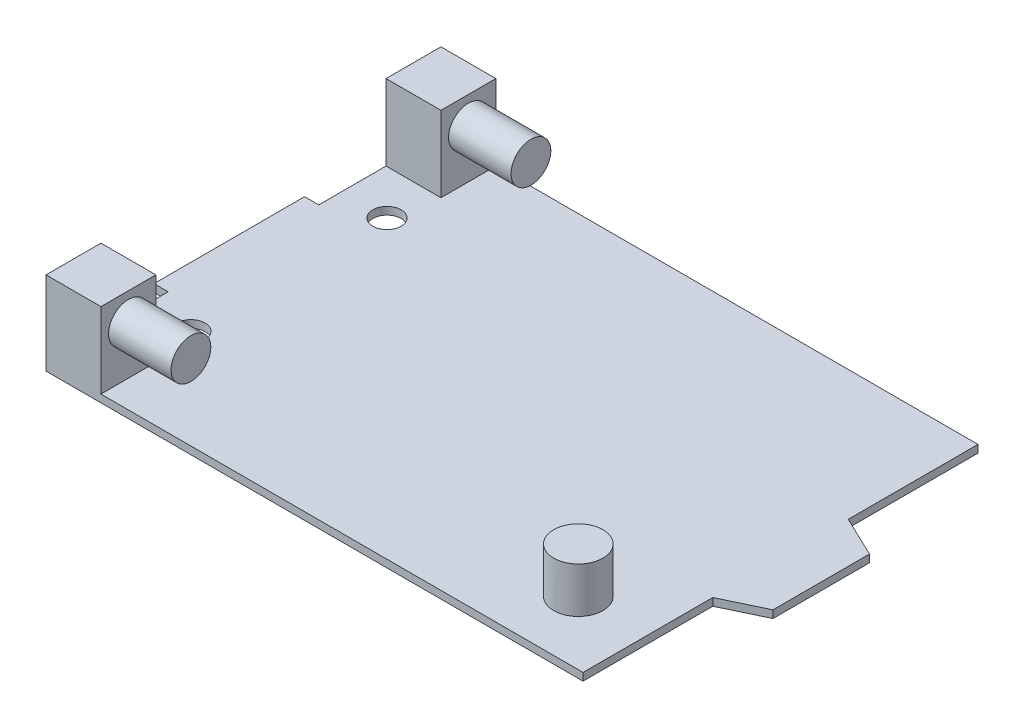
ISO-10303-21;
HEADER;
FILE_DESCRIPTION(('STEP AP214'),'2;1');
FILE_NAME('part.step','',(''),(''),'','','');
FILE_SCHEMA(('AUTOMOTIVE_DESIGN { 1 0 10303 214 1 1 1 1 }'));
ENDSEC;
DATA;
#1=APPLICATION_CONTEXT('core data for automotive mechanical design processes');
#2=APPLICATION_PROTOCOL_DEFINITION('international standard','automotive_design',2000,#1);
#3=PRODUCT_CONTEXT('',#1,'mechanical');
#4=PRODUCT('Part','Part','',(#3));
#5=PRODUCT_RELATED_PRODUCT_CATEGORY('part','',(#4));
#6=PRODUCT_DEFINITION_FORMATION('','',#4);
#7=PRODUCT_DEFINITION_CONTEXT('part definition',#1,'design');
#8=PRODUCT_DEFINITION('design','',#6,#7);
#9=PRODUCT_DEFINITION_SHAPE('','',#8);
#10=(LENGTH_UNIT() NAMED_UNIT(*) SI_UNIT(.MILLI.,.METRE.));
#11=(NAMED_UNIT(*) PLANE_ANGLE_UNIT() SI_UNIT($,.RADIAN.));
#12=(NAMED_UNIT(*) SI_UNIT($,.STERADIAN.) SOLID_ANGLE_UNIT());
#13=UNCERTAINTY_MEASURE_WITH_UNIT(LENGTH_MEASURE(1.E-05),#10,'distance_accuracy_value','');
#14=(GEOMETRIC_REPRESENTATION_CONTEXT(3) GLOBAL_UNCERTAINTY_ASSIGNED_CONTEXT((#13)) GLOBAL_UNIT_ASSIGNED_CONTEXT((#10,
#11,#12)) REPRESENTATION_CONTEXT('',''));
#15=CARTESIAN_POINT('',(0.,0.,0.));
#16=DIRECTION('',(0.,0.,1.));
#17=DIRECTION('',(1.,0.,0.));
#18=AXIS2_PLACEMENT_3D('',#15,#16,#17);
#19=CARTESIAN_POINT('',(0.,1.016,0.));
#20=DIRECTION('',(0.,-1.,0.));
#21=DIRECTION('',(0.,0.,-1.));
#22=AXIS2_PLACEMENT_3D('',#19,#20,#21);
#23=PLANE('',#22);
#24=CARTESIAN_POINT('',(64.77,1.016,7.874));
#25=DIRECTION('',(0.,-1.,0.));
#26=DIRECTION('',(0.,0.,-1.));
#27=AXIS2_PLACEMENT_3D('',#24,#25,#26);
#28=CIRCLE('',#27,3.302);
#29=CARTESIAN_POINT('',(64.77,1.016,4.572));
#30=VERTEX_POINT('',#29);
#31=EDGE_CURVE('E11',#30,#30,#28,.F.);
#32=ORIENTED_EDGE('',*,*,#31,.F.);
#33=EDGE_LOOP('',(#32));
#34=FACE_BOUND('',#33,.T.);
#35=CARTESIAN_POINT('',(8.001,1.016,3.048));
#36=DIRECTION('',(0.,1.,0.));
#37=DIRECTION('',(0.,0.,1.));
#38=AXIS2_PLACEMENT_3D('',#35,#36,#37);
#39=CIRCLE('',#38,1.905);
#40=CARTESIAN_POINT('',(8.001,1.016,4.953));
#41=VERTEX_POINT('',#40);
#42=EDGE_CURVE('E242',#41,#41,#39,.T.);
#43=ORIENTED_EDGE('',*,*,#42,.F.);
#44=EDGE_LOOP('',(#43));
#45=FACE_BOUND('',#44,.T.);
#46=CARTESIAN_POINT('',(8.00099999999999,1.016,-23.241));
#47=DIRECTION('',(0.,1.,0.));
#48=DIRECTION('',(0.,0.,1.));
#49=AXIS2_PLACEMENT_3D('',#46,#47,#48);
#50=CIRCLE('',#49,1.905);
#51=CARTESIAN_POINT('',(8.00099999999999,1.016,-21.336));
#52=VERTEX_POINT('',#51);
#53=EDGE_CURVE('E236',#52,#52,#50,.T.);
#54=ORIENTED_EDGE('',*,*,#53,.F.);
#55=EDGE_LOOP('',(#54));
#56=FACE_BOUND('',#55,.T.);
#57=DIRECTION('',(0.,0.,-1.));
#58=VECTOR('',#57,1.);
#59=CARTESIAN_POINT('',(9.271,1.016,16.383));
#60=LINE('',#59,#58);
#61=CARTESIAN_POINT('',(9.271,1.016,16.383));
#62=VERTEX_POINT('',#61);
#63=CARTESIAN_POINT('',(9.271,1.016,9.017));
#64=VERTEX_POINT('',#63);
#65=EDGE_CURVE('E182',#62,#64,#60,.T.);
#66=ORIENTED_EDGE('',*,*,#65,.F.);
#67=DIRECTION('',(1.,0.,0.));
#68=VECTOR('',#67,1.);
#69=CARTESIAN_POINT('',(1.905,1.016,16.383));
#70=LINE('',#69,#68);
#71=CARTESIAN_POINT('',(73.914,1.016,16.383));
#72=VERTEX_POINT('',#71);
#73=EDGE_CURVE('E171',#62,#72,#70,.T.);
#74=ORIENTED_EDGE('',*,*,#73,.T.);
#75=DIRECTION('',(0.,0.,-1.));
#76=VECTOR('',#75,1.);
#77=CARTESIAN_POINT('',(73.914,1.016,16.383));
#78=LINE('',#77,#76);
#79=CARTESIAN_POINT('',(73.914,1.016,-1.016));
#80=VERTEX_POINT('',#79);
#81=EDGE_CURVE('E180',#72,#80,#78,.T.);
#82=ORIENTED_EDGE('',*,*,#81,.T.);
#83=DIRECTION('',(0.902666413566439,0.,-0.430340964607255));
#84=VECTOR('',#83,1.);
#85=CARTESIAN_POINT('',(73.914,1.016,-1.016));
#86=LINE('',#85,#84);
#87=CARTESIAN_POINT('',(79.375,1.016,-3.6195));
#88=VERTEX_POINT('',#87);
#89=EDGE_CURVE('E253',#80,#88,#86,.T.);
#90=ORIENTED_EDGE('',*,*,#89,.T.);
#91=DIRECTION('',(0.,0.,-1.));
#92=VECTOR('',#91,1.);
#93=CARTESIAN_POINT('',(79.375,1.016,-3.6195));
#94=LINE('',#93,#92);
#95=CARTESIAN_POINT('',(79.375,1.016,-16.5735));
#96=VERTEX_POINT('',#95);
#97=EDGE_CURVE('E255',#88,#96,#94,.T.);
#98=ORIENTED_EDGE('',*,*,#97,.T.);
#99=DIRECTION('',(-0.902666413566438,0.,-0.430340964607256));
#100=VECTOR('',#99,1.);
#101=CARTESIAN_POINT('',(79.375,1.016,-16.5735));
#102=LINE('',#101,#100);
#103=CARTESIAN_POINT('',(73.914,1.016,-19.177));
#104=VERTEX_POINT('',#103);
#105=EDGE_CURVE('E257',#96,#104,#102,.T.);
#106=ORIENTED_EDGE('',*,*,#105,.T.);
#107=DIRECTION('',(0.,0.,-1.));
#108=VECTOR('',#107,1.);
#109=CARTESIAN_POINT('',(73.914,1.016,-19.177));
#110=LINE('',#109,#108);
#111=CARTESIAN_POINT('',(73.914,1.016,-36.576));
#112=VERTEX_POINT('',#111);
#113=EDGE_CURVE('E259',#104,#112,#110,.T.);
#114=ORIENTED_EDGE('',*,*,#113,.T.);
#115=DIRECTION('',(-1.,0.,0.));
#116=VECTOR('',#115,1.);
#117=CARTESIAN_POINT('',(73.914,1.016,-36.576));
#118=LINE('',#117,#116);
#119=CARTESIAN_POINT('',(9.271,1.016,-36.576));
#120=VERTEX_POINT('',#119);
#121=EDGE_CURVE('E261',#112,#120,#118,.T.);
#122=ORIENTED_EDGE('',*,*,#121,.T.);
#123=DIRECTION('',(0.,0.,-1.));
#124=VECTOR('',#123,1.);
#125=CARTESIAN_POINT('',(9.271,1.016,-36.576));
#126=LINE('',#125,#124);
#127=CARTESIAN_POINT('',(9.271,1.016,-29.21));
#128=VERTEX_POINT('',#127);
#129=EDGE_CURVE('E215',#128,#120,#126,.T.);
#130=ORIENTED_EDGE('',*,*,#129,.F.);
#131=DIRECTION('',(1.,0.,0.));
#132=VECTOR('',#131,1.);
#133=CARTESIAN_POINT('',(1.905,1.016,-29.21));
#134=LINE('',#133,#132);
#135=CARTESIAN_POINT('',(1.905,1.016,-29.21));
#136=VERTEX_POINT('',#135);
#137=EDGE_CURVE('E186',#136,#128,#134,.T.);
#138=ORIENTED_EDGE('',*,*,#137,.F.);
#139=DIRECTION('',(0.,0.,1.));
#140=VECTOR('',#139,1.);
#141=CARTESIAN_POINT('',(1.905,1.016,-20.193));
#142=LINE('',#141,#140);
#143=CARTESIAN_POINT('',(1.905,1.016,-20.193));
#144=VERTEX_POINT('',#143);
#145=EDGE_CURVE('E263',#136,#144,#142,.T.);
#146=ORIENTED_EDGE('',*,*,#145,.T.);
#147=DIRECTION('',(-1.,0.,0.));
#148=VECTOR('',#147,1.);
#149=CARTESIAN_POINT('',(0.,1.016,-20.193));
#150=LINE('',#149,#148);
#151=CARTESIAN_POINT('',(0.,1.016,-20.193));
#152=VERTEX_POINT('',#151);
#153=EDGE_CURVE('E265',#144,#152,#150,.T.);
#154=ORIENTED_EDGE('',*,*,#153,.T.);
#155=DIRECTION('',(0.,0.,1.));
#156=VECTOR('',#155,1.);
#157=CARTESIAN_POINT('',(0.,1.016,0.));
#158=LINE('',#157,#156);
#159=CARTESIAN_POINT('',(0.,1.016,0.));
#160=VERTEX_POINT('',#159);
#161=EDGE_CURVE('E267',#152,#160,#158,.T.);
#162=ORIENTED_EDGE('',*,*,#161,.T.);
#163=DIRECTION('',(1.,0.,0.));
#164=VECTOR('',#163,1.);
#165=CARTESIAN_POINT('',(0.,1.016,0.));
#166=LINE('',#165,#164);
#167=CARTESIAN_POINT('',(1.905,1.016,0.));
#168=VERTEX_POINT('',#167);
#169=EDGE_CURVE('E248',#160,#168,#166,.T.);
#170=ORIENTED_EDGE('',*,*,#169,.T.);
#171=DIRECTION('',(0.,0.,1.));
#172=VECTOR('',#171,1.);
#173=CARTESIAN_POINT('',(1.905,1.016,0.));
#174=LINE('',#173,#172);
#175=CARTESIAN_POINT('',(1.905,1.016,9.017));
#176=VERTEX_POINT('',#175);
#177=EDGE_CURVE('E67',#168,#176,#174,.T.);
#178=ORIENTED_EDGE('',*,*,#177,.T.);
#179=DIRECTION('',(-1.,0.,0.));
#180=VECTOR('',#179,1.);
#181=CARTESIAN_POINT('',(1.905,1.016,9.017));
#182=LINE('',#181,#180);
#183=EDGE_CURVE('E62',#64,#176,#182,.T.);
#184=ORIENTED_EDGE('',*,*,#183,.F.);
#185=EDGE_LOOP('',(#66,#74,#82,#90,#98,#106,#114,#122,#130,#138,#146,#154,#162,#170,#178,#184));
#186=FACE_BOUND('',#185,.T.);
#187=ADVANCED_FACE('F47',(#34,#45,#56,#186),#23,.F.);
#188=CARTESIAN_POINT('',(0.,0.,0.));
#189=DIRECTION('',(0.,-1.,0.));
#190=DIRECTION('',(0.,0.,-1.));
#191=AXIS2_PLACEMENT_3D('',#188,#189,#190);
#192=PLANE('',#191);
#193=CARTESIAN_POINT('',(8.001,0.,3.048));
#194=DIRECTION('',(0.,1.,0.));
#195=DIRECTION('',(0.,0.,1.));
#196=AXIS2_PLACEMENT_3D('',#193,#194,#195);
#197=CIRCLE('',#196,1.905);
#198=CARTESIAN_POINT('',(8.001,0.,4.953));
#199=VERTEX_POINT('',#198);
#200=EDGE_CURVE('E239',#199,#199,#197,.T.);
#201=ORIENTED_EDGE('',*,*,#200,.T.);
#202=EDGE_LOOP('',(#201));
#203=FACE_BOUND('',#202,.T.);
#204=DIRECTION('',(1.,0.,0.));
#205=VECTOR('',#204,1.);
#206=CARTESIAN_POINT('',(0.,0.,0.));
#207=LINE('',#206,#205);
#208=CARTESIAN_POINT('',(0.,0.,0.));
#209=VERTEX_POINT('',#208);
#210=CARTESIAN_POINT('',(1.905,0.,0.));
#211=VERTEX_POINT('',#210);
#212=EDGE_CURVE('E245',#209,#211,#207,.T.);
#213=ORIENTED_EDGE('',*,*,#212,.F.);
#214=DIRECTION('',(0.,0.,1.));
#215=VECTOR('',#214,1.);
#216=CARTESIAN_POINT('',(0.,0.,0.));
#217=LINE('',#216,#215);
#218=CARTESIAN_POINT('',(0.,0.,-20.193));
#219=VERTEX_POINT('',#218);
#220=EDGE_CURVE('E250',#219,#209,#217,.T.);
#221=ORIENTED_EDGE('',*,*,#220,.F.);
#222=DIRECTION('',(-1.,0.,0.));
#223=VECTOR('',#222,1.);
#224=CARTESIAN_POINT('',(0.,0.,-20.193));
#225=LINE('',#224,#223);
#226=CARTESIAN_POINT('',(1.905,0.,-20.193));
#227=VERTEX_POINT('',#226);
#228=EDGE_CURVE('E290',#227,#219,#225,.T.);
#229=ORIENTED_EDGE('',*,*,#228,.F.);
#230=DIRECTION('',(0.,0.,1.));
#231=VECTOR('',#230,1.);
#232=CARTESIAN_POINT('',(1.905,0.,-20.193));
#233=LINE('',#232,#231);
#234=CARTESIAN_POINT('',(1.905,0.,-36.576));
#235=VERTEX_POINT('',#234);
#236=EDGE_CURVE('E288',#235,#227,#233,.T.);
#237=ORIENTED_EDGE('',*,*,#236,.F.);
#238=DIRECTION('',(-1.,0.,0.));
#239=VECTOR('',#238,1.);
#240=CARTESIAN_POINT('',(73.914,0.,-36.576));
#241=LINE('',#240,#239);
#242=CARTESIAN_POINT('',(73.914,0.,-36.576));
#243=VERTEX_POINT('',#242);
#244=EDGE_CURVE('E286',#243,#235,#241,.T.);
#245=ORIENTED_EDGE('',*,*,#244,.F.);
#246=DIRECTION('',(0.,0.,-1.));
#247=VECTOR('',#246,1.);
#248=CARTESIAN_POINT('',(73.914,0.,-19.177));
#249=LINE('',#248,#247);
#250=CARTESIAN_POINT('',(73.914,0.,-19.177));
#251=VERTEX_POINT('',#250);
#252=EDGE_CURVE('E284',#251,#243,#249,.T.);
#253=ORIENTED_EDGE('',*,*,#252,.F.);
#254=DIRECTION('',(-0.902666413566438,0.,-0.430340964607256));
#255=VECTOR('',#254,1.);
#256=CARTESIAN_POINT('',(79.375,0.,-16.5735));
#257=LINE('',#256,#255);
#258=CARTESIAN_POINT('',(79.375,0.,-16.5735));
#259=VERTEX_POINT('',#258);
#260=EDGE_CURVE('E282',#259,#251,#257,.T.);
#261=ORIENTED_EDGE('',*,*,#260,.F.);
#262=DIRECTION('',(0.,0.,-1.));
#263=VECTOR('',#262,1.);
#264=CARTESIAN_POINT('',(79.375,0.,-3.6195));
#265=LINE('',#264,#263);
#266=CARTESIAN_POINT('',(79.375,0.,-3.6195));
#267=VERTEX_POINT('',#266);
#268=EDGE_CURVE('E280',#267,#259,#265,.T.);
#269=ORIENTED_EDGE('',*,*,#268,.F.);
#270=DIRECTION('',(0.902666413566439,0.,-0.430340964607255));
#271=VECTOR('',#270,1.);
#272=CARTESIAN_POINT('',(73.914,0.,-1.016));
#273=LINE('',#272,#271);
#274=CARTESIAN_POINT('',(73.914,0.,-1.016));
#275=VERTEX_POINT('',#274);
#276=EDGE_CURVE('E278',#275,#267,#273,.T.);
#277=ORIENTED_EDGE('',*,*,#276,.F.);
#278=DIRECTION('',(0.,0.,-1.));
#279=VECTOR('',#278,1.);
#280=CARTESIAN_POINT('',(73.914,0.,16.383));
#281=LINE('',#280,#279);
#282=CARTESIAN_POINT('',(73.914,0.,16.383));
#283=VERTEX_POINT('',#282);
#284=EDGE_CURVE('E276',#283,#275,#281,.T.);
#285=ORIENTED_EDGE('',*,*,#284,.F.);
#286=DIRECTION('',(1.,0.,0.));
#287=VECTOR('',#286,1.);
#288=CARTESIAN_POINT('',(1.905,0.,16.383));
#289=LINE('',#288,#287);
#290=CARTESIAN_POINT('',(1.905,0.,16.383));
#291=VERTEX_POINT('',#290);
#292=EDGE_CURVE('E274',#291,#283,#289,.T.);
#293=ORIENTED_EDGE('',*,*,#292,.F.);
#294=DIRECTION('',(0.,0.,1.));
#295=VECTOR('',#294,1.);
#296=CARTESIAN_POINT('',(1.905,0.,0.));
#297=LINE('',#296,#295);
#298=EDGE_CURVE('E272',#211,#291,#297,.T.);
#299=ORIENTED_EDGE('',*,*,#298,.F.);
#300=EDGE_LOOP('',(#213,#221,#229,#237,#245,#253,#261,#269,#277,#285,#293,#299));
#301=FACE_BOUND('',#300,.T.);
#302=CARTESIAN_POINT('',(8.00099999999999,0.,-23.241));
#303=DIRECTION('',(0.,1.,0.));
#304=DIRECTION('',(0.,0.,1.));
#305=AXIS2_PLACEMENT_3D('',#302,#303,#304);
#306=CIRCLE('',#305,1.905);
#307=CARTESIAN_POINT('',(8.00099999999999,0.,-21.336));
#308=VERTEX_POINT('',#307);
#309=EDGE_CURVE('E235',#308,#308,#306,.T.);
#310=ORIENTED_EDGE('',*,*,#309,.T.);
#311=EDGE_LOOP('',(#310));
#312=FACE_BOUND('',#311,.T.);
#313=ADVANCED_FACE('F381',(#203,#301,#312),#192,.T.);
#314=CARTESIAN_POINT('',(0.,1.016,0.));
#315=DIRECTION('',(0.,0.,-1.));
#316=DIRECTION('',(-1.,0.,0.));
#317=AXIS2_PLACEMENT_3D('',#314,#315,#316);
#318=PLANE('',#317);
#319=ORIENTED_EDGE('',*,*,#212,.T.);
#320=DIRECTION('',(0.,-1.,0.));
#321=VECTOR('',#320,1.);
#322=CARTESIAN_POINT('',(1.905,1.016,0.));
#323=LINE('',#322,#321);
#324=EDGE_CURVE('E323',#168,#211,#323,.T.);
#325=ORIENTED_EDGE('',*,*,#324,.F.);
#326=ORIENTED_EDGE('',*,*,#169,.F.);
#327=DIRECTION('',(0.,-1.,0.));
#328=VECTOR('',#327,1.);
#329=CARTESIAN_POINT('',(0.,1.016,0.));
#330=LINE('',#329,#328);
#331=EDGE_CURVE('E269',#160,#209,#330,.T.);
#332=ORIENTED_EDGE('',*,*,#331,.T.);
#333=EDGE_LOOP('',(#319,#325,#326,#332));
#334=FACE_BOUND('',#333,.T.);
#335=ADVANCED_FACE('F49',(#334),#318,.F.);
#336=CARTESIAN_POINT('',(1.905,1.016,0.));
#337=DIRECTION('',(1.,0.,0.));
#338=DIRECTION('',(0.,0.,-1.));
#339=AXIS2_PLACEMENT_3D('',#336,#337,#338);
#340=PLANE('',#339);
#341=ORIENTED_EDGE('',*,*,#298,.T.);
#342=DIRECTION('',(0.,-1.,0.));
#343=VECTOR('',#342,1.);
#344=CARTESIAN_POINT('',(1.905,1.016,16.383));
#345=LINE('',#344,#343);
#346=CARTESIAN_POINT('',(1.905,11.176,16.383));
#347=VERTEX_POINT('',#346);
#348=EDGE_CURVE('E320',#347,#291,#345,.T.);
#349=ORIENTED_EDGE('',*,*,#348,.F.);
#350=DIRECTION('',(0.,0.,1.));
#351=VECTOR('',#350,1.);
#352=CARTESIAN_POINT('',(1.905,11.176,16.383));
#353=LINE('',#352,#351);
#354=CARTESIAN_POINT('',(1.905,11.176,9.017));
#355=VERTEX_POINT('',#354);
#356=EDGE_CURVE('E203',#355,#347,#353,.T.);
#357=ORIENTED_EDGE('',*,*,#356,.F.);
#358=DIRECTION('',(0.,-1.,0.));
#359=VECTOR('',#358,1.);
#360=CARTESIAN_POINT('',(1.905,11.176,9.017));
#361=LINE('',#360,#359);
#362=EDGE_CURVE('E193',#355,#176,#361,.T.);
#363=ORIENTED_EDGE('',*,*,#362,.T.);
#364=ORIENTED_EDGE('',*,*,#177,.F.);
#365=ORIENTED_EDGE('',*,*,#324,.T.);
#366=EDGE_LOOP('',(#341,#349,#357,#363,#364,#365));
#367=FACE_BOUND('',#366,.T.);
#368=ADVANCED_FACE('F370',(#367),#340,.F.);
#369=CARTESIAN_POINT('',(1.905,1.016,16.383));
#370=DIRECTION('',(0.,0.,-1.));
#371=DIRECTION('',(-1.,0.,0.));
#372=AXIS2_PLACEMENT_3D('',#369,#370,#371);
#373=PLANE('',#372);
#374=ORIENTED_EDGE('',*,*,#292,.T.);
#375=DIRECTION('',(0.,-1.,0.));
#376=VECTOR('',#375,1.);
#377=CARTESIAN_POINT('',(73.914,1.016,16.383));
#378=LINE('',#377,#376);
#379=EDGE_CURVE('E178',#72,#283,#378,.T.);
#380=ORIENTED_EDGE('',*,*,#379,.F.);
#381=ORIENTED_EDGE('',*,*,#73,.F.);
#382=DIRECTION('',(0.,-1.,0.));
#383=VECTOR('',#382,1.);
#384=CARTESIAN_POINT('',(9.271,11.176,16.383));
#385=LINE('',#384,#383);
#386=CARTESIAN_POINT('',(9.271,11.176,16.383));
#387=VERTEX_POINT('',#386);
#388=EDGE_CURVE('E175',#387,#62,#385,.T.);
#389=ORIENTED_EDGE('',*,*,#388,.F.);
#390=DIRECTION('',(1.,0.,0.));
#391=VECTOR('',#390,1.);
#392=CARTESIAN_POINT('',(1.905,11.176,16.383));
#393=LINE('',#392,#391);
#394=EDGE_CURVE('E207',#347,#387,#393,.T.);
#395=ORIENTED_EDGE('',*,*,#394,.F.);
#396=ORIENTED_EDGE('',*,*,#348,.T.);
#397=EDGE_LOOP('',(#374,#380,#381,#389,#395,#396));
#398=FACE_BOUND('',#397,.T.);
#399=ADVANCED_FACE('F172',(#398),#373,.F.);
#400=CARTESIAN_POINT('',(73.914,1.016,16.383));
#401=DIRECTION('',(-1.,0.,0.));
#402=DIRECTION('',(0.,0.,1.));
#403=AXIS2_PLACEMENT_3D('',#400,#401,#402);
#404=PLANE('',#403);
#405=ORIENTED_EDGE('',*,*,#284,.T.);
#406=DIRECTION('',(0.,-1.,0.));
#407=VECTOR('',#406,1.);
#408=CARTESIAN_POINT('',(73.914,1.016,-1.016));
#409=LINE('',#408,#407);
#410=EDGE_CURVE('E316',#80,#275,#409,.T.);
#411=ORIENTED_EDGE('',*,*,#410,.F.);
#412=ORIENTED_EDGE('',*,*,#81,.F.);
#413=ORIENTED_EDGE('',*,*,#379,.T.);
#414=EDGE_LOOP('',(#405,#411,#412,#413));
#415=FACE_BOUND('',#414,.T.);
#416=ADVANCED_FACE('F387',(#415),#404,.F.);
#417=CARTESIAN_POINT('',(73.914,1.016,-1.016));
#418=DIRECTION('',(-0.430340964607255,0.,-0.902666413566439));
#419=DIRECTION('',(-0.902666413566439,0.,0.430340964607255));
#420=AXIS2_PLACEMENT_3D('',#417,#418,#419);
#421=PLANE('',#420);
#422=ORIENTED_EDGE('',*,*,#276,.T.);
#423=DIRECTION('',(0.,-1.,0.));
#424=VECTOR('',#423,1.);
#425=CARTESIAN_POINT('',(79.375,1.016,-3.6195));
#426=LINE('',#425,#424);
#427=EDGE_CURVE('E313',#88,#267,#426,.T.);
#428=ORIENTED_EDGE('',*,*,#427,.F.);
#429=ORIENTED_EDGE('',*,*,#89,.F.);
#430=ORIENTED_EDGE('',*,*,#410,.T.);
#431=EDGE_LOOP('',(#422,#428,#429,#430));
#432=FACE_BOUND('',#431,.T.);
#433=ADVANCED_FACE('F390',(#432),#421,.F.);
#434=CARTESIAN_POINT('',(79.375,1.016,-3.6195));
#435=DIRECTION('',(-1.,0.,0.));
#436=DIRECTION('',(0.,0.,1.));
#437=AXIS2_PLACEMENT_3D('',#434,#435,#436);
#438=PLANE('',#437);
#439=ORIENTED_EDGE('',*,*,#268,.T.);
#440=DIRECTION('',(0.,-1.,0.));
#441=VECTOR('',#440,1.);
#442=CARTESIAN_POINT('',(79.375,1.016,-16.5735));
#443=LINE('',#442,#441);
#444=EDGE_CURVE('E310',#96,#259,#443,.T.);
#445=ORIENTED_EDGE('',*,*,#444,.F.);
#446=ORIENTED_EDGE('',*,*,#97,.F.);
#447=ORIENTED_EDGE('',*,*,#427,.T.);
#448=EDGE_LOOP('',(#439,#445,#446,#447));
#449=FACE_BOUND('',#448,.T.);
#450=ADVANCED_FACE('F397',(#449),#438,.F.);
#451=CARTESIAN_POINT('',(79.375,1.016,-16.5735));
#452=DIRECTION('',(-0.430340964607256,0.,0.902666413566439));
#453=DIRECTION('',(0.902666413566439,0.,0.430340964607256));
#454=AXIS2_PLACEMENT_3D('',#451,#452,#453);
#455=PLANE('',#454);
#456=ORIENTED_EDGE('',*,*,#260,.T.);
#457=DIRECTION('',(0.,-1.,0.));
#458=VECTOR('',#457,1.);
#459=CARTESIAN_POINT('',(73.914,1.016,-19.177));
#460=LINE('',#459,#458);
#461=EDGE_CURVE('E307',#104,#251,#460,.T.);
#462=ORIENTED_EDGE('',*,*,#461,.F.);
#463=ORIENTED_EDGE('',*,*,#105,.F.);
#464=ORIENTED_EDGE('',*,*,#444,.T.);
#465=EDGE_LOOP('',(#456,#462,#463,#464));
#466=FACE_BOUND('',#465,.T.);
#467=ADVANCED_FACE('F400',(#466),#455,.F.);
#468=CARTESIAN_POINT('',(73.914,1.016,-19.177));
#469=DIRECTION('',(-1.,0.,0.));
#470=DIRECTION('',(0.,0.,1.));
#471=AXIS2_PLACEMENT_3D('',#468,#469,#470);
#472=PLANE('',#471);
#473=ORIENTED_EDGE('',*,*,#252,.T.);
#474=DIRECTION('',(0.,-1.,0.));
#475=VECTOR('',#474,1.);
#476=CARTESIAN_POINT('',(73.914,1.016,-36.576));
#477=LINE('',#476,#475);
#478=EDGE_CURVE('E304',#112,#243,#477,.T.);
#479=ORIENTED_EDGE('',*,*,#478,.F.);
#480=ORIENTED_EDGE('',*,*,#113,.F.);
#481=ORIENTED_EDGE('',*,*,#461,.T.);
#482=EDGE_LOOP('',(#473,#479,#480,#481));
#483=FACE_BOUND('',#482,.T.);
#484=ADVANCED_FACE('F405',(#483),#472,.F.);
#485=CARTESIAN_POINT('',(73.914,1.016,-36.576));
#486=DIRECTION('',(0.,0.,1.));
#487=DIRECTION('',(1.,0.,0.));
#488=AXIS2_PLACEMENT_3D('',#485,#486,#487);
#489=PLANE('',#488);
#490=ORIENTED_EDGE('',*,*,#244,.T.);
#491=DIRECTION('',(0.,-1.,0.));
#492=VECTOR('',#491,1.);
#493=CARTESIAN_POINT('',(1.905,1.016,-36.576));
#494=LINE('',#493,#492);
#495=CARTESIAN_POINT('',(1.905,11.176,-36.576));
#496=VERTEX_POINT('',#495);
#497=EDGE_CURVE('E301',#496,#235,#494,.T.);
#498=ORIENTED_EDGE('',*,*,#497,.F.);
#499=DIRECTION('',(-1.,0.,0.));
#500=VECTOR('',#499,1.);
#501=CARTESIAN_POINT('',(1.905,11.176,-36.576));
#502=LINE('',#501,#500);
#503=CARTESIAN_POINT('',(9.271,11.176,-36.576));
#504=VERTEX_POINT('',#503);
#505=EDGE_CURVE('E219',#504,#496,#502,.T.);
#506=ORIENTED_EDGE('',*,*,#505,.F.);
#507=DIRECTION('',(0.,-1.,0.));
#508=VECTOR('',#507,1.);
#509=CARTESIAN_POINT('',(9.271,11.176,-36.576));
#510=LINE('',#509,#508);
#511=EDGE_CURVE('E222',#504,#120,#510,.T.);
#512=ORIENTED_EDGE('',*,*,#511,.T.);
#513=ORIENTED_EDGE('',*,*,#121,.F.);
#514=ORIENTED_EDGE('',*,*,#478,.T.);
#515=EDGE_LOOP('',(#490,#498,#506,#512,#513,#514));
#516=FACE_BOUND('',#515,.T.);
#517=ADVANCED_FACE('F345',(#516),#489,.F.);
#518=CARTESIAN_POINT('',(1.905,1.016,-20.193));
#519=DIRECTION('',(1.,0.,0.));
#520=DIRECTION('',(0.,0.,-1.));
#521=AXIS2_PLACEMENT_3D('',#518,#519,#520);
#522=PLANE('',#521);
#523=ORIENTED_EDGE('',*,*,#236,.T.);
#524=DIRECTION('',(0.,-1.,0.));
#525=VECTOR('',#524,1.);
#526=CARTESIAN_POINT('',(1.905,1.016,-20.193));
#527=LINE('',#526,#525);
#528=EDGE_CURVE('E298',#144,#227,#527,.T.);
#529=ORIENTED_EDGE('',*,*,#528,.F.);
#530=ORIENTED_EDGE('',*,*,#145,.F.);
#531=DIRECTION('',(0.,-1.,0.));
#532=VECTOR('',#531,1.);
#533=CARTESIAN_POINT('',(1.905,11.176,-29.21));
#534=LINE('',#533,#532);
#535=CARTESIAN_POINT('',(1.905,11.176,-29.21));
#536=VERTEX_POINT('',#535);
#537=EDGE_CURVE('E232',#536,#136,#534,.T.);
#538=ORIENTED_EDGE('',*,*,#537,.F.);
#539=DIRECTION('',(0.,0.,1.));
#540=VECTOR('',#539,1.);
#541=CARTESIAN_POINT('',(1.905,11.176,-36.576));
#542=LINE('',#541,#540);
#543=EDGE_CURVE('E211',#496,#536,#542,.T.);
#544=ORIENTED_EDGE('',*,*,#543,.F.);
#545=ORIENTED_EDGE('',*,*,#497,.T.);
#546=EDGE_LOOP('',(#523,#529,#530,#538,#544,#545));
#547=FACE_BOUND('',#546,.T.);
#548=ADVANCED_FACE('F350',(#547),#522,.F.);
#549=CARTESIAN_POINT('',(0.,1.016,-20.193));
#550=DIRECTION('',(0.,0.,1.));
#551=DIRECTION('',(1.,0.,0.));
#552=AXIS2_PLACEMENT_3D('',#549,#550,#551);
#553=PLANE('',#552);
#554=ORIENTED_EDGE('',*,*,#228,.T.);
#555=DIRECTION('',(0.,-1.,0.));
#556=VECTOR('',#555,1.);
#557=CARTESIAN_POINT('',(0.,1.016,-20.193));
#558=LINE('',#557,#556);
#559=EDGE_CURVE('E295',#152,#219,#558,.T.);
#560=ORIENTED_EDGE('',*,*,#559,.F.);
#561=ORIENTED_EDGE('',*,*,#153,.F.);
#562=ORIENTED_EDGE('',*,*,#528,.T.);
#563=EDGE_LOOP('',(#554,#560,#561,#562));
#564=FACE_BOUND('',#563,.T.);
#565=ADVANCED_FACE('F359',(#564),#553,.F.);
#566=CARTESIAN_POINT('',(0.,1.016,0.));
#567=DIRECTION('',(1.,0.,0.));
#568=DIRECTION('',(0.,0.,-1.));
#569=AXIS2_PLACEMENT_3D('',#566,#567,#568);
#570=PLANE('',#569);
#571=ORIENTED_EDGE('',*,*,#220,.T.);
#572=ORIENTED_EDGE('',*,*,#331,.F.);
#573=ORIENTED_EDGE('',*,*,#161,.F.);
#574=ORIENTED_EDGE('',*,*,#559,.T.);
#575=EDGE_LOOP('',(#571,#572,#573,#574));
#576=FACE_BOUND('',#575,.T.);
#577=ADVANCED_FACE('F364',(#576),#570,.F.);
#578=CARTESIAN_POINT('',(8.001,1.016,3.048));
#579=DIRECTION('',(0.,-1.,0.));
#580=DIRECTION('',(0.,0.,-1.));
#581=AXIS2_PLACEMENT_3D('',#578,#579,#580);
#582=CYLINDRICAL_SURFACE('',#581,1.905);
#583=ORIENTED_EDGE('',*,*,#42,.T.);
#584=EDGE_LOOP('',(#583));
#585=FACE_BOUND('',#584,.T.);
#586=ORIENTED_EDGE('',*,*,#200,.F.);
#587=EDGE_LOOP('',(#586));
#588=FACE_BOUND('',#587,.T.);
#589=ADVANCED_FACE('F426',(#585,#588),#582,.F.);
#590=CARTESIAN_POINT('',(8.00099999999999,1.016,-23.241));
#591=DIRECTION('',(0.,-1.,0.));
#592=DIRECTION('',(0.,0.,-1.));
#593=AXIS2_PLACEMENT_3D('',#590,#591,#592);
#594=CYLINDRICAL_SURFACE('',#593,1.905);
#595=ORIENTED_EDGE('',*,*,#53,.T.);
#596=EDGE_LOOP('',(#595));
#597=FACE_BOUND('',#596,.T.);
#598=ORIENTED_EDGE('',*,*,#309,.F.);
#599=EDGE_LOOP('',(#598));
#600=FACE_BOUND('',#599,.T.);
#601=ADVANCED_FACE('F452',(#597,#600),#594,.F.);
#602=CARTESIAN_POINT('',(1.905,11.176,-29.21));
#603=DIRECTION('',(0.,0.,-1.));
#604=DIRECTION('',(-1.,0.,0.));
#605=AXIS2_PLACEMENT_3D('',#602,#603,#604);
#606=PLANE('',#605);
#607=ORIENTED_EDGE('',*,*,#137,.T.);
#608=DIRECTION('',(0.,-1.,0.));
#609=VECTOR('',#608,1.);
#610=CARTESIAN_POINT('',(9.271,11.176,-29.21));
#611=LINE('',#610,#609);
#612=CARTESIAN_POINT('',(9.271,11.176,-29.21));
#613=VERTEX_POINT('',#612);
#614=EDGE_CURVE('E229',#613,#128,#611,.T.);
#615=ORIENTED_EDGE('',*,*,#614,.F.);
#616=DIRECTION('',(1.,0.,0.));
#617=VECTOR('',#616,1.);
#618=CARTESIAN_POINT('',(1.905,11.176,-29.21));
#619=LINE('',#618,#617);
#620=EDGE_CURVE('E214',#536,#613,#619,.T.);
#621=ORIENTED_EDGE('',*,*,#620,.F.);
#622=ORIENTED_EDGE('',*,*,#537,.T.);
#623=EDGE_LOOP('',(#607,#615,#621,#622));
#624=FACE_BOUND('',#623,.T.);
#625=ADVANCED_FACE('F337',(#624),#606,.F.);
#626=CARTESIAN_POINT('',(9.271,11.176,-36.576));
#627=DIRECTION('',(-1.,0.,0.));
#628=DIRECTION('',(0.,0.,1.));
#629=AXIS2_PLACEMENT_3D('',#626,#627,#628);
#630=PLANE('',#629);
#631=CARTESIAN_POINT('',(9.271,7.493,-32.893));
#632=DIRECTION('',(-1.,0.,0.));
#633=DIRECTION('',(0.,0.,1.));
#634=AXIS2_PLACEMENT_3D('',#631,#632,#633);
#635=CIRCLE('',#634,2.667);
#636=CARTESIAN_POINT('',(9.271,7.493,-30.226));
#637=VERTEX_POINT('',#636);
#638=EDGE_CURVE('E55',#637,#637,#635,.F.);
#639=ORIENTED_EDGE('',*,*,#638,.F.);
#640=EDGE_LOOP('',(#639));
#641=FACE_BOUND('',#640,.T.);
#642=ORIENTED_EDGE('',*,*,#129,.T.);
#643=ORIENTED_EDGE('',*,*,#511,.F.);
#644=DIRECTION('',(0.,0.,-1.));
#645=VECTOR('',#644,1.);
#646=CARTESIAN_POINT('',(9.271,11.176,-36.576));
#647=LINE('',#646,#645);
#648=EDGE_CURVE('E217',#613,#504,#647,.T.);
#649=ORIENTED_EDGE('',*,*,#648,.F.);
#650=ORIENTED_EDGE('',*,*,#614,.T.);
#651=EDGE_LOOP('',(#642,#643,#649,#650));
#652=FACE_BOUND('',#651,.T.);
#653=ADVANCED_FACE('F333',(#641,#652),#630,.F.);
#654=CARTESIAN_POINT('',(0.,11.176,0.));
#655=DIRECTION('',(0.,1.,0.));
#656=DIRECTION('',(0.,0.,1.));
#657=AXIS2_PLACEMENT_3D('',#654,#655,#656);
#658=PLANE('',#657);
#659=ORIENTED_EDGE('',*,*,#543,.T.);
#660=ORIENTED_EDGE('',*,*,#620,.T.);
#661=ORIENTED_EDGE('',*,*,#648,.T.);
#662=ORIENTED_EDGE('',*,*,#505,.T.);
#663=EDGE_LOOP('',(#659,#660,#661,#662));
#664=FACE_BOUND('',#663,.T.);
#665=ADVANCED_FACE('F336',(#664),#658,.T.);
#666=CARTESIAN_POINT('',(9.271,11.176,16.383));
#667=DIRECTION('',(-1.,0.,0.));
#668=DIRECTION('',(0.,0.,1.));
#669=AXIS2_PLACEMENT_3D('',#666,#667,#668);
#670=PLANE('',#669);
#671=CARTESIAN_POINT('',(9.271,7.493,12.7));
#672=DIRECTION('',(-1.,0.,0.));
#673=DIRECTION('',(0.,0.,1.));
#674=AXIS2_PLACEMENT_3D('',#671,#672,#673);
#675=CIRCLE('',#674,2.667);
#676=CARTESIAN_POINT('',(9.271,7.493,15.367));
#677=VERTEX_POINT('',#676);
#678=EDGE_CURVE('E326',#677,#677,#675,.F.);
#679=ORIENTED_EDGE('',*,*,#678,.F.);
#680=EDGE_LOOP('',(#679));
#681=FACE_BOUND('',#680,.T.);
#682=ORIENTED_EDGE('',*,*,#65,.T.);
#683=DIRECTION('',(0.,-1.,0.));
#684=VECTOR('',#683,1.);
#685=CARTESIAN_POINT('',(9.271,11.176,9.017));
#686=LINE('',#685,#684);
#687=CARTESIAN_POINT('',(9.271,11.176,9.017));
#688=VERTEX_POINT('',#687);
#689=EDGE_CURVE('E190',#688,#64,#686,.T.);
#690=ORIENTED_EDGE('',*,*,#689,.F.);
#691=DIRECTION('',(0.,0.,-1.));
#692=VECTOR('',#691,1.);
#693=CARTESIAN_POINT('',(9.271,11.176,16.383));
#694=LINE('',#693,#692);
#695=EDGE_CURVE('E189',#387,#688,#694,.T.);
#696=ORIENTED_EDGE('',*,*,#695,.F.);
#697=ORIENTED_EDGE('',*,*,#388,.T.);
#698=EDGE_LOOP('',(#682,#690,#696,#697));
#699=FACE_BOUND('',#698,.T.);
#700=ADVANCED_FACE('F188',(#681,#699),#670,.F.);
#701=CARTESIAN_POINT('',(1.905,11.176,9.017));
#702=DIRECTION('',(0.,0.,1.));
#703=DIRECTION('',(1.,0.,0.));
#704=AXIS2_PLACEMENT_3D('',#701,#702,#703);
#705=PLANE('',#704);
#706=ORIENTED_EDGE('',*,*,#183,.T.);
#707=ORIENTED_EDGE('',*,*,#362,.F.);
#708=DIRECTION('',(-1.,0.,0.));
#709=VECTOR('',#708,1.);
#710=CARTESIAN_POINT('',(1.905,11.176,9.017));
#711=LINE('',#710,#709);
#712=EDGE_CURVE('E202',#688,#355,#711,.T.);
#713=ORIENTED_EDGE('',*,*,#712,.F.);
#714=ORIENTED_EDGE('',*,*,#689,.T.);
#715=EDGE_LOOP('',(#706,#707,#713,#714));
#716=FACE_BOUND('',#715,.T.);
#717=ADVANCED_FACE('F375',(#716),#705,.F.);
#718=CARTESIAN_POINT('',(0.,11.176,0.));
#719=DIRECTION('',(0.,-1.,0.));
#720=DIRECTION('',(0.,0.,-1.));
#721=AXIS2_PLACEMENT_3D('',#718,#719,#720);
#722=PLANE('',#721);
#723=ORIENTED_EDGE('',*,*,#356,.T.);
#724=ORIENTED_EDGE('',*,*,#394,.T.);
#725=ORIENTED_EDGE('',*,*,#695,.T.);
#726=ORIENTED_EDGE('',*,*,#712,.T.);
#727=EDGE_LOOP('',(#723,#724,#725,#726));
#728=FACE_BOUND('',#727,.T.);
#729=ADVANCED_FACE('F377',(#728),#722,.F.);
#730=CARTESIAN_POINT('',(17.653,7.493,12.7));
#731=DIRECTION('',(-1.,0.,0.));
#732=DIRECTION('',(0.,0.,1.));
#733=AXIS2_PLACEMENT_3D('',#730,#731,#732);
#734=CYLINDRICAL_SURFACE('',#733,2.667);
#735=CARTESIAN_POINT('',(17.653,7.493,12.7));
#736=DIRECTION('',(1.,0.,0.));
#737=DIRECTION('',(0.,0.,-1.));
#738=AXIS2_PLACEMENT_3D('',#735,#736,#737);
#739=CIRCLE('',#738,2.667);
#740=CARTESIAN_POINT('',(17.653,7.493,10.033));
#741=VERTEX_POINT('',#740);
#742=EDGE_CURVE('E191',#741,#741,#739,.T.);
#743=ORIENTED_EDGE('',*,*,#742,.F.);
#744=EDGE_LOOP('',(#743));
#745=FACE_BOUND('',#744,.T.);
#746=ORIENTED_EDGE('',*,*,#678,.T.);
#747=EDGE_LOOP('',(#746));
#748=FACE_BOUND('',#747,.T.);
#749=ADVANCED_FACE('F494',(#745,#748),#734,.T.);
#750=CARTESIAN_POINT('',(17.653,0.,0.));
#751=DIRECTION('',(1.,0.,0.));
#752=DIRECTION('',(0.,0.,-1.));
#753=AXIS2_PLACEMENT_3D('',#750,#751,#752);
#754=PLANE('',#753);
#755=ORIENTED_EDGE('',*,*,#742,.T.);
#756=EDGE_LOOP('',(#755));
#757=FACE_BOUND('',#756,.T.);
#758=ADVANCED_FACE('F501',(#757),#754,.T.);
#759=CARTESIAN_POINT('',(17.653,7.493,-32.893));
#760=DIRECTION('',(-1.,0.,0.));
#761=DIRECTION('',(0.,0.,1.));
#762=AXIS2_PLACEMENT_3D('',#759,#760,#761);
#763=CYLINDRICAL_SURFACE('',#762,2.667);
#764=CARTESIAN_POINT('',(17.653,7.493,-32.893));
#765=DIRECTION('',(1.,0.,0.));
#766=DIRECTION('',(0.,0.,-1.));
#767=AXIS2_PLACEMENT_3D('',#764,#765,#766);
#768=CIRCLE('',#767,2.667);
#769=CARTESIAN_POINT('',(17.653,7.493,-35.56));
#770=VERTEX_POINT('',#769);
#771=EDGE_CURVE('E196',#770,#770,#768,.T.);
#772=ORIENTED_EDGE('',*,*,#771,.F.);
#773=EDGE_LOOP('',(#772));
#774=FACE_BOUND('',#773,.T.);
#775=ORIENTED_EDGE('',*,*,#638,.T.);
#776=EDGE_LOOP('',(#775));
#777=FACE_BOUND('',#776,.T.);
#778=ADVANCED_FACE('F331',(#774,#777),#763,.T.);
#779=CARTESIAN_POINT('',(17.653,0.,0.));
#780=DIRECTION('',(1.,0.,0.));
#781=DIRECTION('',(0.,0.,-1.));
#782=AXIS2_PLACEMENT_3D('',#779,#780,#781);
#783=PLANE('',#782);
#784=ORIENTED_EDGE('',*,*,#771,.T.);
#785=EDGE_LOOP('',(#784));
#786=FACE_BOUND('',#785,.T.);
#787=ADVANCED_FACE('F516',(#786),#783,.T.);
#788=CARTESIAN_POINT('',(64.77,7.112,7.874));
#789=DIRECTION('',(0.,-1.,0.));
#790=DIRECTION('',(0.,0.,-1.));
#791=AXIS2_PLACEMENT_3D('',#788,#789,#790);
#792=CYLINDRICAL_SURFACE('',#791,3.302);
#793=CARTESIAN_POINT('',(64.77,7.112,7.874));
#794=DIRECTION('',(0.,1.,0.));
#795=DIRECTION('',(0.,0.,1.));
#796=AXIS2_PLACEMENT_3D('',#793,#794,#795);
#797=CIRCLE('',#796,3.302);
#798=CARTESIAN_POINT('',(64.77,7.112,11.176));
#799=VERTEX_POINT('',#798);
#800=EDGE_CURVE('E805',#799,#799,#797,.T.);
#801=ORIENTED_EDGE('',*,*,#800,.F.);
#802=EDGE_LOOP('',(#801));
#803=FACE_BOUND('',#802,.T.);
#804=ORIENTED_EDGE('',*,*,#31,.T.);
#805=EDGE_LOOP('',(#804));
#806=FACE_BOUND('',#805,.T.);
#807=ADVANCED_FACE('F524',(#803,#806),#792,.T.);
#808=CARTESIAN_POINT('',(0.,7.112,0.));
#809=DIRECTION('',(0.,1.,0.));
#810=DIRECTION('',(0.,0.,1.));
#811=AXIS2_PLACEMENT_3D('',#808,#809,#810);
#812=PLANE('',#811);
#813=ORIENTED_EDGE('',*,*,#800,.T.);
#814=EDGE_LOOP('',(#813));
#815=FACE_BOUND('',#814,.T.);
#816=ADVANCED_FACE('F532',(#815),#812,.T.);
#817=CLOSED_SHELL('',(#187,#313,#335,#368,#399,#416,#433,#450,#467,#484,#517,#548,#565,#577,
#589,#601,#625,#653,#665,#700,#717,#729,#749,#758,#778,#787,#807,#816));
#818=MANIFOLD_SOLID_BREP('B2',#817);
#819=ADVANCED_BREP_SHAPE_REPRESENTATION('',(#18,#818),#14);
#820=SHAPE_DEFINITION_REPRESENTATION(#9,#819);
ENDSEC;
END-ISO-10303-21;
